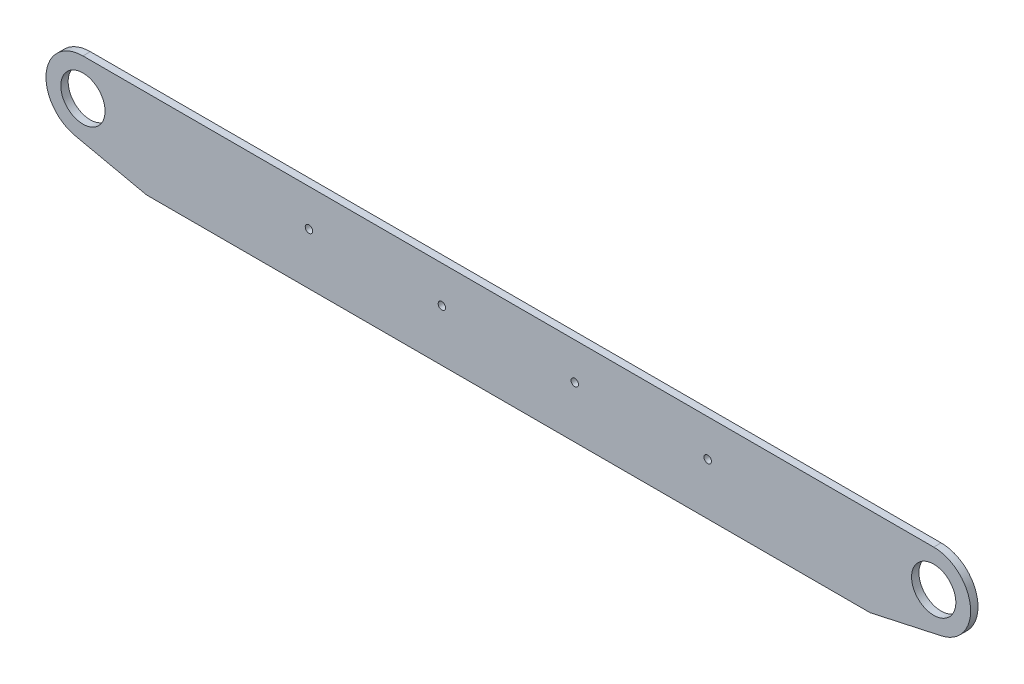
ISO-10303-21;
HEADER;
FILE_DESCRIPTION(('STEP AP214'),'2;1');
FILE_NAME('part.step','',(''),(''),'','','');
FILE_SCHEMA(('AUTOMOTIVE_DESIGN { 1 0 10303 214 1 1 1 1 }'));
ENDSEC;
DATA;
#1=APPLICATION_CONTEXT('core data for automotive mechanical design processes');
#2=APPLICATION_PROTOCOL_DEFINITION('international standard','automotive_design',2000,#1);
#3=PRODUCT_CONTEXT('',#1,'mechanical');
#4=PRODUCT('Part','Part','',(#3));
#5=PRODUCT_RELATED_PRODUCT_CATEGORY('part','',(#4));
#6=PRODUCT_DEFINITION_FORMATION('','',#4);
#7=PRODUCT_DEFINITION_CONTEXT('part definition',#1,'design');
#8=PRODUCT_DEFINITION('design','',#6,#7);
#9=PRODUCT_DEFINITION_SHAPE('','',#8);
#10=(LENGTH_UNIT() NAMED_UNIT(*) SI_UNIT(.MILLI.,.METRE.));
#11=(NAMED_UNIT(*) PLANE_ANGLE_UNIT() SI_UNIT($,.RADIAN.));
#12=(NAMED_UNIT(*) SI_UNIT($,.STERADIAN.) SOLID_ANGLE_UNIT());
#13=UNCERTAINTY_MEASURE_WITH_UNIT(LENGTH_MEASURE(1.E-05),#10,'distance_accuracy_value','');
#14=(GEOMETRIC_REPRESENTATION_CONTEXT(3) GLOBAL_UNCERTAINTY_ASSIGNED_CONTEXT((#13)) GLOBAL_UNIT_ASSIGNED_CONTEXT((#10,
#11,#12)) REPRESENTATION_CONTEXT('',''));
#15=CARTESIAN_POINT('',(0.,0.,0.));
#16=DIRECTION('',(0.,0.,1.));
#17=DIRECTION('',(1.,0.,0.));
#18=AXIS2_PLACEMENT_3D('',#15,#16,#17);
#19=CARTESIAN_POINT('',(-171.449999999993,577.85,463.549999999998));
#20=DIRECTION('',(0.,0.,1.));
#21=DIRECTION('',(1.,0.,0.));
#22=AXIS2_PLACEMENT_3D('',#19,#20,#21);
#23=CYLINDRICAL_SURFACE('',#22,3.17499999999998);
#24=CARTESIAN_POINT('',(-171.449999999993,577.85,457.199999999998));
#25=DIRECTION('',(0.,0.,1.));
#26=DIRECTION('',(1.,0.,0.));
#27=AXIS2_PLACEMENT_3D('',#24,#25,#26);
#28=CIRCLE('',#27,3.17499999999998);
#29=CARTESIAN_POINT('',(-168.274999999993,577.85,457.199999999998));
#30=VERTEX_POINT('',#29);
#31=EDGE_CURVE('E51',#30,#30,#28,.T.);
#32=ORIENTED_EDGE('',*,*,#31,.F.);
#33=EDGE_LOOP('',(#32));
#34=FACE_BOUND('',#33,.T.);
#35=CARTESIAN_POINT('',(-171.449999999993,577.85,463.549999999998));
#36=DIRECTION('',(0.,0.,1.));
#37=DIRECTION('',(1.,0.,0.));
#38=AXIS2_PLACEMENT_3D('',#35,#36,#37);
#39=CIRCLE('',#38,3.17499999999998);
#40=CARTESIAN_POINT('',(-168.274999999993,577.85,463.549999999998));
#41=VERTEX_POINT('',#40);
#42=EDGE_CURVE('E11',#41,#41,#39,.T.);
#43=ORIENTED_EDGE('',*,*,#42,.T.);
#44=EDGE_LOOP('',(#43));
#45=FACE_BOUND('',#44,.T.);
#46=ADVANCED_FACE('F43',(#34,#45),#23,.F.);
#47=CARTESIAN_POINT('',(-57.149999999993,577.85,463.549999999998));
#48=DIRECTION('',(0.,0.,1.));
#49=DIRECTION('',(1.,0.,0.));
#50=AXIS2_PLACEMENT_3D('',#47,#48,#49);
#51=CYLINDRICAL_SURFACE('',#50,3.17499999999998);
#52=CARTESIAN_POINT('',(-57.149999999993,577.85,457.199999999998));
#53=DIRECTION('',(0.,0.,1.));
#54=DIRECTION('',(1.,0.,0.));
#55=AXIS2_PLACEMENT_3D('',#52,#53,#54);
#56=CIRCLE('',#55,3.17499999999998);
#57=CARTESIAN_POINT('',(-53.9749999999931,577.85,457.199999999998));
#58=VERTEX_POINT('',#57);
#59=EDGE_CURVE('E168',#58,#58,#56,.T.);
#60=ORIENTED_EDGE('',*,*,#59,.F.);
#61=EDGE_LOOP('',(#60));
#62=FACE_BOUND('',#61,.T.);
#63=CARTESIAN_POINT('',(-57.149999999993,577.85,463.549999999998));
#64=DIRECTION('',(0.,0.,1.));
#65=DIRECTION('',(1.,0.,0.));
#66=AXIS2_PLACEMENT_3D('',#63,#64,#65);
#67=CIRCLE('',#66,3.17499999999998);
#68=CARTESIAN_POINT('',(-53.9749999999931,577.85,463.549999999998));
#69=VERTEX_POINT('',#68);
#70=EDGE_CURVE('E171',#69,#69,#67,.T.);
#71=ORIENTED_EDGE('',*,*,#70,.T.);
#72=EDGE_LOOP('',(#71));
#73=FACE_BOUND('',#72,.T.);
#74=ADVANCED_FACE('F180',(#62,#73),#51,.F.);
#75=CARTESIAN_POINT('',(-311.149999999993,533.4,463.549999999998));
#76=DIRECTION('',(0.,1.,0.));
#77=DIRECTION('',(0.,0.,1.));
#78=AXIS2_PLACEMENT_3D('',#75,#76,#77);
#79=PLANE('',#78);
#80=DIRECTION('',(1.,0.,0.));
#81=VECTOR('',#80,1.);
#82=CARTESIAN_POINT('',(-311.149999999993,533.4,457.199999999998));
#83=LINE('',#82,#81);
#84=CARTESIAN_POINT('',(-311.149999999993,533.4,457.199999999998));
#85=VERTEX_POINT('',#84);
#86=CARTESIAN_POINT('',(311.150000000007,533.4,457.199999999998));
#87=VERTEX_POINT('',#86);
#88=EDGE_CURVE('E100',#85,#87,#83,.T.);
#89=ORIENTED_EDGE('',*,*,#88,.T.);
#90=DIRECTION('',(0.,0.,-1.));
#91=VECTOR('',#90,1.);
#92=CARTESIAN_POINT('',(311.150000000007,533.4,463.549999999998));
#93=LINE('',#92,#91);
#94=CARTESIAN_POINT('',(311.150000000007,533.4,463.549999999998));
#95=VERTEX_POINT('',#94);
#96=EDGE_CURVE('E161',#95,#87,#93,.T.);
#97=ORIENTED_EDGE('',*,*,#96,.F.);
#98=DIRECTION('',(1.,0.,0.));
#99=VECTOR('',#98,1.);
#100=CARTESIAN_POINT('',(-311.149999999993,533.4,463.549999999998));
#101=LINE('',#100,#99);
#102=CARTESIAN_POINT('',(-311.149999999993,533.4,463.549999999998));
#103=VERTEX_POINT('',#102);
#104=EDGE_CURVE('E58',#103,#95,#101,.T.);
#105=ORIENTED_EDGE('',*,*,#104,.F.);
#106=DIRECTION('',(0.,0.,-1.));
#107=VECTOR('',#106,1.);
#108=CARTESIAN_POINT('',(-311.149999999993,533.4,463.549999999998));
#109=LINE('',#108,#107);
#110=EDGE_CURVE('E166',#103,#85,#109,.T.);
#111=ORIENTED_EDGE('',*,*,#110,.T.);
#112=EDGE_LOOP('',(#89,#97,#105,#111));
#113=FACE_BOUND('',#112,.T.);
#114=ADVANCED_FACE('F209',(#113),#79,.F.);
#115=CARTESIAN_POINT('',(-311.149999999993,609.6,463.549999999998));
#116=DIRECTION('',(0.,-1.,0.));
#117=DIRECTION('',(0.,0.,-1.));
#118=AXIS2_PLACEMENT_3D('',#115,#116,#117);
#119=PLANE('',#118);
#120=DIRECTION('',(-1.,0.,0.));
#121=VECTOR('',#120,1.);
#122=CARTESIAN_POINT('',(-311.149999999993,609.6,457.199999999998));
#123=LINE('',#122,#121);
#124=CARTESIAN_POINT('',(365.806235462429,609.6,457.199999999998));
#125=VERTEX_POINT('',#124);
#126=CARTESIAN_POINT('',(-365.806235462429,609.6,457.199999999998));
#127=VERTEX_POINT('',#126);
#128=EDGE_CURVE('E159',#125,#127,#123,.T.);
#129=ORIENTED_EDGE('',*,*,#128,.T.);
#130=DIRECTION('',(0.,0.,1.));
#131=VECTOR('',#130,1.);
#132=CARTESIAN_POINT('',(-365.806235462429,609.6,341.993760903379));
#133=LINE('',#132,#131);
#134=CARTESIAN_POINT('',(-365.806235462429,609.6,463.549999999998));
#135=VERTEX_POINT('',#134);
#136=EDGE_CURVE('E117',#127,#135,#133,.T.);
#137=ORIENTED_EDGE('',*,*,#136,.T.);
#138=DIRECTION('',(-1.,0.,0.));
#139=VECTOR('',#138,1.);
#140=CARTESIAN_POINT('',(-311.149999999993,609.6,463.549999999998));
#141=LINE('',#140,#139);
#142=CARTESIAN_POINT('',(365.806235462429,609.6,463.549999999998));
#143=VERTEX_POINT('',#142);
#144=EDGE_CURVE('E158',#143,#135,#141,.T.);
#145=ORIENTED_EDGE('',*,*,#144,.F.);
#146=DIRECTION('',(0.,0.,1.));
#147=VECTOR('',#146,1.);
#148=CARTESIAN_POINT('',(365.806235462429,609.6,341.993760903379));
#149=LINE('',#148,#147);
#150=EDGE_CURVE('E131',#125,#143,#149,.T.);
#151=ORIENTED_EDGE('',*,*,#150,.F.);
#152=EDGE_LOOP('',(#129,#137,#145,#151));
#153=FACE_BOUND('',#152,.T.);
#154=ADVANCED_FACE('F186',(#153),#119,.F.);
#155=CARTESIAN_POINT('',(0.,0.,463.549999999998));
#156=DIRECTION('',(0.,0.,1.));
#157=DIRECTION('',(1.,0.,0.));
#158=AXIS2_PLACEMENT_3D('',#155,#156,#157);
#159=PLANE('',#158);
#160=CARTESIAN_POINT('',(57.150000000007,577.85,463.549999999998));
#161=DIRECTION('',(0.,0.,1.));
#162=DIRECTION('',(1.,0.,0.));
#163=AXIS2_PLACEMENT_3D('',#160,#161,#162);
#164=CIRCLE('',#163,3.17499999999998);
#165=CARTESIAN_POINT('',(60.3250000000069,577.85,463.549999999998));
#166=VERTEX_POINT('',#165);
#167=EDGE_CURVE('E148',#166,#166,#164,.T.);
#168=ORIENTED_EDGE('',*,*,#167,.F.);
#169=EDGE_LOOP('',(#168));
#170=FACE_BOUND('',#169,.T.);
#171=CARTESIAN_POINT('',(171.450000000007,577.85,463.549999999998));
#172=DIRECTION('',(0.,0.,1.));
#173=DIRECTION('',(1.,0.,0.));
#174=AXIS2_PLACEMENT_3D('',#171,#172,#173);
#175=CIRCLE('',#174,3.17499999999998);
#176=CARTESIAN_POINT('',(174.625000000007,577.85,463.549999999998));
#177=VERTEX_POINT('',#176);
#178=EDGE_CURVE('E151',#177,#177,#175,.T.);
#179=ORIENTED_EDGE('',*,*,#178,.F.);
#180=EDGE_LOOP('',(#179));
#181=FACE_BOUND('',#180,.T.);
#182=ORIENTED_EDGE('',*,*,#144,.T.);
#183=CARTESIAN_POINT('',(-365.806235462429,577.85,463.549999999998));
#184=DIRECTION('',(0.,0.,-1.));
#185=DIRECTION('',(-1.,0.,0.));
#186=AXIS2_PLACEMENT_3D('',#183,#184,#185);
#187=CIRCLE('',#186,31.75);
#188=CARTESIAN_POINT('',(-372.587826170908,546.832705993871,463.549999999998));
#189=VERTEX_POINT('',#188);
#190=EDGE_CURVE('E113',#189,#135,#187,.T.);
#191=ORIENTED_EDGE('',*,*,#190,.F.);
#192=DIRECTION('',(-0.976922645862337,0.213593408141099,0.));
#193=VECTOR('',#192,1.);
#194=CARTESIAN_POINT('',(-311.150000000007,533.4,463.549999999998));
#195=LINE('',#194,#193);
#196=EDGE_CURVE('E104',#103,#189,#195,.T.);
#197=ORIENTED_EDGE('',*,*,#196,.F.);
#198=ORIENTED_EDGE('',*,*,#104,.T.);
#199=DIRECTION('',(0.976922645862337,0.213593408141099,0.));
#200=VECTOR('',#199,1.);
#201=CARTESIAN_POINT('',(311.150000000007,533.4,463.549999999998));
#202=LINE('',#201,#200);
#203=CARTESIAN_POINT('',(372.587826170908,546.832705993871,463.549999999998));
#204=VERTEX_POINT('',#203);
#205=EDGE_CURVE('E134',#95,#204,#202,.T.);
#206=ORIENTED_EDGE('',*,*,#205,.T.);
#207=CARTESIAN_POINT('',(365.806235462429,577.85,463.549999999998));
#208=DIRECTION('',(0.,0.,1.));
#209=DIRECTION('',(1.,0.,0.));
#210=AXIS2_PLACEMENT_3D('',#207,#208,#209);
#211=CIRCLE('',#210,31.75);
#212=EDGE_CURVE('E136',#204,#143,#211,.T.);
#213=ORIENTED_EDGE('',*,*,#212,.T.);
#214=EDGE_LOOP('',(#182,#191,#197,#198,#206,#213));
#215=FACE_BOUND('',#214,.T.);
#216=ORIENTED_EDGE('',*,*,#70,.F.);
#217=EDGE_LOOP('',(#216));
#218=FACE_BOUND('',#217,.T.);
#219=ORIENTED_EDGE('',*,*,#42,.F.);
#220=EDGE_LOOP('',(#219));
#221=FACE_BOUND('',#220,.T.);
#222=CARTESIAN_POINT('',(365.806235462429,577.85,463.549999999998));
#223=DIRECTION('',(0.,0.,1.));
#224=DIRECTION('',(1.,0.,0.));
#225=AXIS2_PLACEMENT_3D('',#222,#223,#224);
#226=CIRCLE('',#225,19.05);
#227=CARTESIAN_POINT('',(384.856235462429,577.85,463.549999999998));
#228=VERTEX_POINT('',#227);
#229=EDGE_CURVE('E125',#228,#228,#226,.T.);
#230=ORIENTED_EDGE('',*,*,#229,.F.);
#231=EDGE_LOOP('',(#230));
#232=FACE_BOUND('',#231,.T.);
#233=CARTESIAN_POINT('',(-365.806235462429,577.85,463.549999999998));
#234=DIRECTION('',(0.,0.,-1.));
#235=DIRECTION('',(-1.,0.,0.));
#236=AXIS2_PLACEMENT_3D('',#233,#234,#235);
#237=CIRCLE('',#236,19.05);
#238=CARTESIAN_POINT('',(-384.856235462429,577.85,463.549999999998));
#239=VERTEX_POINT('',#238);
#240=EDGE_CURVE('E105',#239,#239,#237,.T.);
#241=ORIENTED_EDGE('',*,*,#240,.T.);
#242=EDGE_LOOP('',(#241));
#243=FACE_BOUND('',#242,.T.);
#244=ADVANCED_FACE('F183',(#170,#181,#215,#218,#221,#232,#243),#159,.T.);
#245=CARTESIAN_POINT('',(0.,0.,457.199999999998));
#246=DIRECTION('',(0.,0.,1.));
#247=DIRECTION('',(1.,0.,0.));
#248=AXIS2_PLACEMENT_3D('',#245,#246,#247);
#249=PLANE('',#248);
#250=CARTESIAN_POINT('',(57.150000000007,577.85,457.199999999998));
#251=DIRECTION('',(0.,0.,1.));
#252=DIRECTION('',(1.,0.,0.));
#253=AXIS2_PLACEMENT_3D('',#250,#251,#252);
#254=CIRCLE('',#253,3.17499999999998);
#255=CARTESIAN_POINT('',(60.3250000000069,577.85,457.199999999998));
#256=VERTEX_POINT('',#255);
#257=EDGE_CURVE('E145',#256,#256,#254,.T.);
#258=ORIENTED_EDGE('',*,*,#257,.T.);
#259=EDGE_LOOP('',(#258));
#260=FACE_BOUND('',#259,.T.);
#261=CARTESIAN_POINT('',(171.450000000007,577.85,457.199999999998));
#262=DIRECTION('',(0.,0.,1.));
#263=DIRECTION('',(1.,0.,0.));
#264=AXIS2_PLACEMENT_3D('',#261,#262,#263);
#265=CIRCLE('',#264,3.17499999999998);
#266=CARTESIAN_POINT('',(174.625000000007,577.85,457.199999999998));
#267=VERTEX_POINT('',#266);
#268=EDGE_CURVE('E154',#267,#267,#265,.T.);
#269=ORIENTED_EDGE('',*,*,#268,.T.);
#270=EDGE_LOOP('',(#269));
#271=FACE_BOUND('',#270,.T.);
#272=ORIENTED_EDGE('',*,*,#88,.F.);
#273=DIRECTION('',(0.976922645862338,-0.213593408141099,0.));
#274=VECTOR('',#273,1.);
#275=CARTESIAN_POINT('',(-311.150000000007,533.4,457.199999999998));
#276=LINE('',#275,#274);
#277=CARTESIAN_POINT('',(-372.587826170908,546.832705993871,457.199999999998));
#278=VERTEX_POINT('',#277);
#279=EDGE_CURVE('E92',#278,#85,#276,.T.);
#280=ORIENTED_EDGE('',*,*,#279,.F.);
#281=CARTESIAN_POINT('',(-365.806235462429,577.85,457.199999999998));
#282=DIRECTION('',(0.,0.,1.));
#283=DIRECTION('',(1.,0.,0.));
#284=AXIS2_PLACEMENT_3D('',#281,#282,#283);
#285=CIRCLE('',#284,31.75);
#286=EDGE_CURVE('E97',#127,#278,#285,.T.);
#287=ORIENTED_EDGE('',*,*,#286,.F.);
#288=ORIENTED_EDGE('',*,*,#128,.F.);
#289=CARTESIAN_POINT('',(365.806235462429,577.85,457.199999999998));
#290=DIRECTION('',(0.,0.,1.));
#291=DIRECTION('',(1.,0.,0.));
#292=AXIS2_PLACEMENT_3D('',#289,#290,#291);
#293=CIRCLE('',#292,31.75);
#294=CARTESIAN_POINT('',(372.587826170908,546.832705993871,457.199999999998));
#295=VERTEX_POINT('',#294);
#296=EDGE_CURVE('E129',#125,#295,#293,.F.);
#297=ORIENTED_EDGE('',*,*,#296,.T.);
#298=DIRECTION('',(-0.976922645862338,-0.213593408141099,0.));
#299=VECTOR('',#298,1.);
#300=CARTESIAN_POINT('',(311.150000000007,533.4,457.199999999998));
#301=LINE('',#300,#299);
#302=EDGE_CURVE('E126',#295,#87,#301,.T.);
#303=ORIENTED_EDGE('',*,*,#302,.T.);
#304=EDGE_LOOP('',(#272,#280,#287,#288,#297,#303));
#305=FACE_BOUND('',#304,.T.);
#306=ORIENTED_EDGE('',*,*,#59,.T.);
#307=EDGE_LOOP('',(#306));
#308=FACE_BOUND('',#307,.T.);
#309=ORIENTED_EDGE('',*,*,#31,.T.);
#310=EDGE_LOOP('',(#309));
#311=FACE_BOUND('',#310,.T.);
#312=CARTESIAN_POINT('',(365.806235462429,577.85,457.199999999998));
#313=DIRECTION('',(0.,0.,1.));
#314=DIRECTION('',(1.,0.,0.));
#315=AXIS2_PLACEMENT_3D('',#312,#313,#314);
#316=CIRCLE('',#315,19.05);
#317=CARTESIAN_POINT('',(384.856235462429,577.85,457.199999999998));
#318=VERTEX_POINT('',#317);
#319=EDGE_CURVE('E128',#318,#318,#316,.F.);
#320=ORIENTED_EDGE('',*,*,#319,.F.);
#321=EDGE_LOOP('',(#320));
#322=FACE_BOUND('',#321,.T.);
#323=CARTESIAN_POINT('',(-365.806235462429,577.85,457.199999999998));
#324=DIRECTION('',(0.,0.,1.));
#325=DIRECTION('',(1.,0.,0.));
#326=AXIS2_PLACEMENT_3D('',#323,#324,#325);
#327=CIRCLE('',#326,19.05);
#328=CARTESIAN_POINT('',(-346.756235462429,577.85,457.199999999998));
#329=VERTEX_POINT('',#328);
#330=EDGE_CURVE('E122',#329,#329,#327,.T.);
#331=ORIENTED_EDGE('',*,*,#330,.T.);
#332=EDGE_LOOP('',(#331));
#333=FACE_BOUND('',#332,.T.);
#334=ADVANCED_FACE('F94',(#260,#271,#305,#308,#311,#322,#333),#249,.F.);
#335=CARTESIAN_POINT('',(171.450000000007,577.85,463.549999999998));
#336=DIRECTION('',(0.,0.,1.));
#337=DIRECTION('',(1.,0.,0.));
#338=AXIS2_PLACEMENT_3D('',#335,#336,#337);
#339=CYLINDRICAL_SURFACE('',#338,3.17499999999998);
#340=ORIENTED_EDGE('',*,*,#268,.F.);
#341=EDGE_LOOP('',(#340));
#342=FACE_BOUND('',#341,.T.);
#343=ORIENTED_EDGE('',*,*,#178,.T.);
#344=EDGE_LOOP('',(#343));
#345=FACE_BOUND('',#344,.T.);
#346=ADVANCED_FACE('F221',(#342,#345),#339,.F.);
#347=CARTESIAN_POINT('',(57.150000000007,577.85,463.549999999998));
#348=DIRECTION('',(0.,0.,1.));
#349=DIRECTION('',(1.,0.,0.));
#350=AXIS2_PLACEMENT_3D('',#347,#348,#349);
#351=CYLINDRICAL_SURFACE('',#350,3.17499999999998);
#352=ORIENTED_EDGE('',*,*,#257,.F.);
#353=EDGE_LOOP('',(#352));
#354=FACE_BOUND('',#353,.T.);
#355=ORIENTED_EDGE('',*,*,#167,.T.);
#356=EDGE_LOOP('',(#355));
#357=FACE_BOUND('',#356,.T.);
#358=ADVANCED_FACE('F226',(#354,#357),#351,.F.);
#359=CARTESIAN_POINT('',(311.150000000007,533.4,341.993760903379));
#360=DIRECTION('',(0.213593408141099,-0.976922645862337,0.));
#361=DIRECTION('',(0.976922645862338,0.213593408141099,0.));
#362=AXIS2_PLACEMENT_3D('',#359,#360,#361);
#363=PLANE('',#362);
#364=ORIENTED_EDGE('',*,*,#302,.F.);
#365=DIRECTION('',(0.,0.,1.));
#366=VECTOR('',#365,1.);
#367=CARTESIAN_POINT('',(372.587826170908,546.832705993871,341.993760903379));
#368=LINE('',#367,#366);
#369=EDGE_CURVE('E139',#295,#204,#368,.T.);
#370=ORIENTED_EDGE('',*,*,#369,.T.);
#371=ORIENTED_EDGE('',*,*,#205,.F.);
#372=ORIENTED_EDGE('',*,*,#96,.T.);
#373=EDGE_LOOP('',(#364,#370,#371,#372));
#374=FACE_BOUND('',#373,.T.);
#375=ADVANCED_FACE('F207',(#374),#363,.T.);
#376=CARTESIAN_POINT('',(365.806235462429,577.85,341.993760903379));
#377=DIRECTION('',(0.,0.,1.));
#378=DIRECTION('',(1.,0.,0.));
#379=AXIS2_PLACEMENT_3D('',#376,#377,#378);
#380=CYLINDRICAL_SURFACE('',#379,31.75);
#381=ORIENTED_EDGE('',*,*,#296,.F.);
#382=ORIENTED_EDGE('',*,*,#150,.T.);
#383=ORIENTED_EDGE('',*,*,#212,.F.);
#384=ORIENTED_EDGE('',*,*,#369,.F.);
#385=EDGE_LOOP('',(#381,#382,#383,#384));
#386=FACE_BOUND('',#385,.T.);
#387=ADVANCED_FACE('F202',(#386),#380,.T.);
#388=CARTESIAN_POINT('',(365.806235462429,577.85,341.993760903379));
#389=DIRECTION('',(0.,0.,1.));
#390=DIRECTION('',(1.,0.,0.));
#391=AXIS2_PLACEMENT_3D('',#388,#389,#390);
#392=CYLINDRICAL_SURFACE('',#391,19.05);
#393=ORIENTED_EDGE('',*,*,#319,.T.);
#394=EDGE_LOOP('',(#393));
#395=FACE_BOUND('',#394,.T.);
#396=ORIENTED_EDGE('',*,*,#229,.T.);
#397=EDGE_LOOP('',(#396));
#398=FACE_BOUND('',#397,.T.);
#399=ADVANCED_FACE('F235',(#395,#398),#392,.F.);
#400=CARTESIAN_POINT('',(-311.150000000007,533.4,341.993760903379));
#401=DIRECTION('',(0.213593408141099,0.976922645862337,0.));
#402=DIRECTION('',(-0.976922645862338,0.213593408141099,0.));
#403=AXIS2_PLACEMENT_3D('',#400,#401,#402);
#404=PLANE('',#403);
#405=DIRECTION('',(0.,0.,1.));
#406=VECTOR('',#405,1.);
#407=CARTESIAN_POINT('',(-372.587826170908,546.832705993871,341.993760903379));
#408=LINE('',#407,#406);
#409=EDGE_CURVE('E108',#278,#189,#408,.T.);
#410=ORIENTED_EDGE('',*,*,#409,.F.);
#411=ORIENTED_EDGE('',*,*,#279,.T.);
#412=ORIENTED_EDGE('',*,*,#110,.F.);
#413=ORIENTED_EDGE('',*,*,#196,.T.);
#414=EDGE_LOOP('',(#410,#411,#412,#413));
#415=FACE_BOUND('',#414,.T.);
#416=ADVANCED_FACE('F109',(#415),#404,.F.);
#417=CARTESIAN_POINT('',(-365.806235462429,577.85,341.993760903379));
#418=DIRECTION('',(0.,0.,1.));
#419=DIRECTION('',(1.,0.,0.));
#420=AXIS2_PLACEMENT_3D('',#417,#418,#419);
#421=CYLINDRICAL_SURFACE('',#420,31.75);
#422=ORIENTED_EDGE('',*,*,#136,.F.);
#423=ORIENTED_EDGE('',*,*,#286,.T.);
#424=ORIENTED_EDGE('',*,*,#409,.T.);
#425=ORIENTED_EDGE('',*,*,#190,.T.);
#426=EDGE_LOOP('',(#422,#423,#424,#425));
#427=FACE_BOUND('',#426,.T.);
#428=ADVANCED_FACE('F115',(#427),#421,.T.);
#429=CARTESIAN_POINT('',(-365.806235462429,577.85,341.993760903379));
#430=DIRECTION('',(0.,0.,1.));
#431=DIRECTION('',(1.,0.,0.));
#432=AXIS2_PLACEMENT_3D('',#429,#430,#431);
#433=CYLINDRICAL_SURFACE('',#432,19.05);
#434=ORIENTED_EDGE('',*,*,#330,.F.);
#435=EDGE_LOOP('',(#434));
#436=FACE_BOUND('',#435,.T.);
#437=ORIENTED_EDGE('',*,*,#240,.F.);
#438=EDGE_LOOP('',(#437));
#439=FACE_BOUND('',#438,.T.);
#440=ADVANCED_FACE('F238',(#436,#439),#433,.F.);
#441=CLOSED_SHELL('',(#46,#74,#114,#154,#244,#334,#346,#358,#375,#387,#399,#416,#428,#440));
#442=MANIFOLD_SOLID_BREP('B2',#441);
#443=ADVANCED_BREP_SHAPE_REPRESENTATION('',(#18,#442),#14);
#444=SHAPE_DEFINITION_REPRESENTATION(#9,#443);
ENDSEC;
END-ISO-10303-21;
